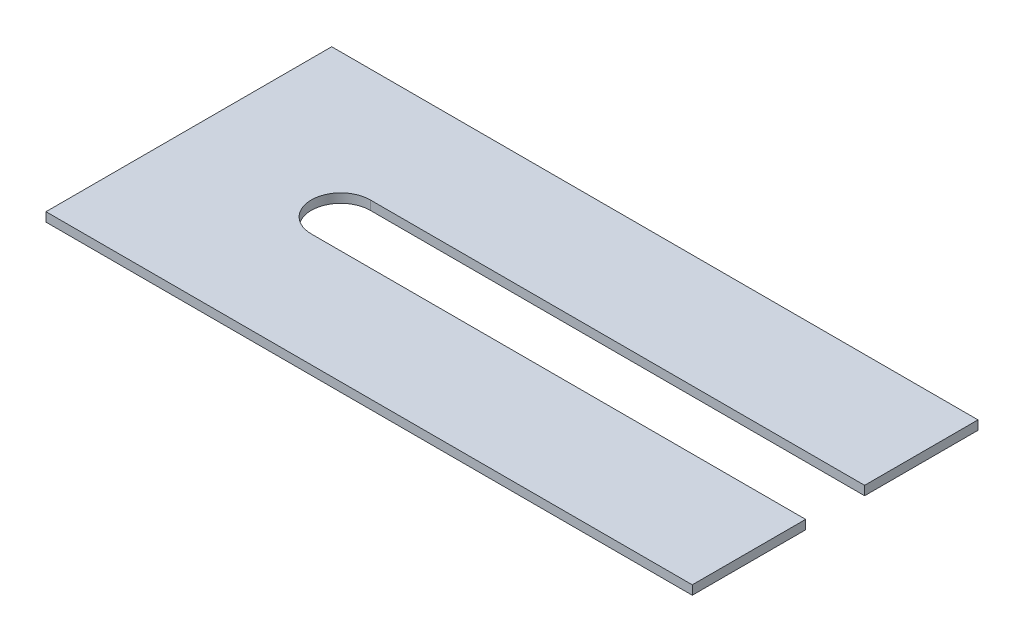
ISO-10303-21;
HEADER;
FILE_DESCRIPTION(('STEP AP214'),'2;1');
FILE_NAME('part.step','',(''),(''),'','','');
FILE_SCHEMA(('AUTOMOTIVE_DESIGN { 1 0 10303 214 1 1 1 1 }'));
ENDSEC;
DATA;
#1=APPLICATION_CONTEXT('core data for automotive mechanical design processes');
#2=APPLICATION_PROTOCOL_DEFINITION('international standard','automotive_design',2000,#1);
#3=PRODUCT_CONTEXT('',#1,'mechanical');
#4=PRODUCT('Part','Part','',(#3));
#5=PRODUCT_RELATED_PRODUCT_CATEGORY('part','',(#4));
#6=PRODUCT_DEFINITION_FORMATION('','',#4);
#7=PRODUCT_DEFINITION_CONTEXT('part definition',#1,'design');
#8=PRODUCT_DEFINITION('design','',#6,#7);
#9=PRODUCT_DEFINITION_SHAPE('','',#8);
#10=(LENGTH_UNIT() NAMED_UNIT(*) SI_UNIT(.MILLI.,.METRE.));
#11=(NAMED_UNIT(*) PLANE_ANGLE_UNIT() SI_UNIT($,.RADIAN.));
#12=(NAMED_UNIT(*) SI_UNIT($,.STERADIAN.) SOLID_ANGLE_UNIT());
#13=UNCERTAINTY_MEASURE_WITH_UNIT(LENGTH_MEASURE(1.E-05),#10,'distance_accuracy_value','');
#14=(GEOMETRIC_REPRESENTATION_CONTEXT(3) GLOBAL_UNCERTAINTY_ASSIGNED_CONTEXT((#13)) GLOBAL_UNIT_ASSIGNED_CONTEXT((#10,
#11,#12)) REPRESENTATION_CONTEXT('',''));
#15=CARTESIAN_POINT('',(0.,0.,0.));
#16=DIRECTION('',(0.,0.,1.));
#17=DIRECTION('',(1.,0.,0.));
#18=AXIS2_PLACEMENT_3D('',#15,#16,#17);
#19=CARTESIAN_POINT('',(16.75,1.,-15.75));
#20=DIRECTION('',(0.,-1.,0.));
#21=DIRECTION('',(0.,0.,-1.));
#22=AXIS2_PLACEMENT_3D('',#19,#20,#21);
#23=CYLINDRICAL_SURFACE('',#22,3.25);
#24=CARTESIAN_POINT('',(16.75,0.,-15.75));
#25=DIRECTION('',(0.,1.,0.));
#26=DIRECTION('',(0.,0.,1.));
#27=AXIS2_PLACEMENT_3D('',#24,#25,#26);
#28=CIRCLE('',#27,3.25);
#29=CARTESIAN_POINT('',(16.75,0.,-19.));
#30=VERTEX_POINT('',#29);
#31=CARTESIAN_POINT('',(16.75,0.,-12.5));
#32=VERTEX_POINT('',#31);
#33=EDGE_CURVE('E191',#30,#32,#28,.T.);
#34=ORIENTED_EDGE('',*,*,#33,.F.);
#35=DIRECTION('',(0.,-1.,0.));
#36=VECTOR('',#35,1.);
#37=CARTESIAN_POINT('',(16.75,1.,-19.));
#38=LINE('',#37,#36);
#39=CARTESIAN_POINT('',(16.75,1.,-19.));
#40=VERTEX_POINT('',#39);
#41=EDGE_CURVE('E11',#40,#30,#38,.T.);
#42=ORIENTED_EDGE('',*,*,#41,.F.);
#43=CARTESIAN_POINT('',(16.75,1.,-15.75));
#44=DIRECTION('',(0.,1.,0.));
#45=DIRECTION('',(0.,0.,1.));
#46=AXIS2_PLACEMENT_3D('',#43,#44,#45);
#47=CIRCLE('',#46,3.25);
#48=CARTESIAN_POINT('',(16.75,1.,-12.5));
#49=VERTEX_POINT('',#48);
#50=EDGE_CURVE('E147',#40,#49,#47,.T.);
#51=ORIENTED_EDGE('',*,*,#50,.T.);
#52=DIRECTION('',(0.,-1.,0.));
#53=VECTOR('',#52,1.);
#54=CARTESIAN_POINT('',(16.75,1.,-12.5));
#55=LINE('',#54,#53);
#56=EDGE_CURVE('E91',#49,#32,#55,.T.);
#57=ORIENTED_EDGE('',*,*,#56,.T.);
#58=EDGE_LOOP('',(#34,#42,#51,#57));
#59=FACE_BOUND('',#58,.T.);
#60=ADVANCED_FACE('F39',(#59),#23,.F.);
#61=CARTESIAN_POINT('',(0.,1.,-19.));
#62=DIRECTION('',(0.,0.,1.));
#63=DIRECTION('',(1.,0.,0.));
#64=AXIS2_PLACEMENT_3D('',#61,#62,#63);
#65=PLANE('',#64);
#66=DIRECTION('',(-1.,0.,0.));
#67=VECTOR('',#66,1.);
#68=CARTESIAN_POINT('',(0.,0.,-19.));
#69=LINE('',#68,#67);
#70=CARTESIAN_POINT('',(71.25,0.,-19.));
#71=VERTEX_POINT('',#70);
#72=EDGE_CURVE('E184',#71,#30,#69,.T.);
#73=ORIENTED_EDGE('',*,*,#72,.F.);
#74=DIRECTION('',(0.,-1.,0.));
#75=VECTOR('',#74,1.);
#76=CARTESIAN_POINT('',(71.25,1.,-19.));
#77=LINE('',#76,#75);
#78=CARTESIAN_POINT('',(71.25,1.,-19.));
#79=VERTEX_POINT('',#78);
#80=EDGE_CURVE('E48',#79,#71,#77,.T.);
#81=ORIENTED_EDGE('',*,*,#80,.F.);
#82=DIRECTION('',(-1.,0.,0.));
#83=VECTOR('',#82,1.);
#84=CARTESIAN_POINT('',(0.,1.,-19.));
#85=LINE('',#84,#83);
#86=EDGE_CURVE('E139',#79,#40,#85,.T.);
#87=ORIENTED_EDGE('',*,*,#86,.T.);
#88=ORIENTED_EDGE('',*,*,#41,.T.);
#89=EDGE_LOOP('',(#73,#81,#87,#88));
#90=FACE_BOUND('',#89,.T.);
#91=ADVANCED_FACE('F189',(#90),#65,.T.);
#92=CARTESIAN_POINT('',(71.25,1.,0.));
#93=DIRECTION('',(-1.,0.,0.));
#94=DIRECTION('',(0.,0.,1.));
#95=AXIS2_PLACEMENT_3D('',#92,#93,#94);
#96=PLANE('',#95);
#97=DIRECTION('',(0.,0.,-1.));
#98=VECTOR('',#97,1.);
#99=CARTESIAN_POINT('',(71.25,0.,0.));
#100=LINE('',#99,#98);
#101=CARTESIAN_POINT('',(71.25,0.,-31.5));
#102=VERTEX_POINT('',#101);
#103=EDGE_CURVE('E159',#71,#102,#100,.T.);
#104=ORIENTED_EDGE('',*,*,#103,.T.);
#105=DIRECTION('',(0.,-1.,0.));
#106=VECTOR('',#105,1.);
#107=CARTESIAN_POINT('',(71.25,1.,-31.5));
#108=LINE('',#107,#106);
#109=CARTESIAN_POINT('',(71.25,1.,-31.5));
#110=VERTEX_POINT('',#109);
#111=EDGE_CURVE('E172',#110,#102,#108,.T.);
#112=ORIENTED_EDGE('',*,*,#111,.F.);
#113=DIRECTION('',(0.,0.,-1.));
#114=VECTOR('',#113,1.);
#115=CARTESIAN_POINT('',(71.25,1.,0.));
#116=LINE('',#115,#114);
#117=EDGE_CURVE('E132',#79,#110,#116,.T.);
#118=ORIENTED_EDGE('',*,*,#117,.F.);
#119=ORIENTED_EDGE('',*,*,#80,.T.);
#120=EDGE_LOOP('',(#104,#112,#118,#119));
#121=FACE_BOUND('',#120,.T.);
#122=ADVANCED_FACE('F178',(#121),#96,.F.);
#123=CARTESIAN_POINT('',(0.,1.,-31.5));
#124=DIRECTION('',(0.,0.,-1.));
#125=DIRECTION('',(-1.,0.,0.));
#126=AXIS2_PLACEMENT_3D('',#123,#124,#125);
#127=PLANE('',#126);
#128=DIRECTION('',(1.,0.,0.));
#129=VECTOR('',#128,1.);
#130=CARTESIAN_POINT('',(0.,0.,-31.5));
#131=LINE('',#130,#129);
#132=CARTESIAN_POINT('',(0.,0.,-31.5));
#133=VERTEX_POINT('',#132);
#134=EDGE_CURVE('E187',#133,#102,#131,.T.);
#135=ORIENTED_EDGE('',*,*,#134,.F.);
#136=DIRECTION('',(0.,-1.,0.));
#137=VECTOR('',#136,1.);
#138=CARTESIAN_POINT('',(0.,1.,-31.5));
#139=LINE('',#138,#137);
#140=CARTESIAN_POINT('',(0.,1.,-31.5));
#141=VERTEX_POINT('',#140);
#142=EDGE_CURVE('E169',#141,#133,#139,.T.);
#143=ORIENTED_EDGE('',*,*,#142,.F.);
#144=DIRECTION('',(1.,0.,0.));
#145=VECTOR('',#144,1.);
#146=CARTESIAN_POINT('',(0.,1.,-31.5));
#147=LINE('',#146,#145);
#148=EDGE_CURVE('E138',#141,#110,#147,.T.);
#149=ORIENTED_EDGE('',*,*,#148,.T.);
#150=ORIENTED_EDGE('',*,*,#111,.T.);
#151=EDGE_LOOP('',(#135,#143,#149,#150));
#152=FACE_BOUND('',#151,.T.);
#153=ADVANCED_FACE('F204',(#152),#127,.T.);
#154=CARTESIAN_POINT('',(0.,1.,0.));
#155=DIRECTION('',(-1.,0.,0.));
#156=DIRECTION('',(0.,0.,1.));
#157=AXIS2_PLACEMENT_3D('',#154,#155,#156);
#158=PLANE('',#157);
#159=DIRECTION('',(0.,0.,-1.));
#160=VECTOR('',#159,1.);
#161=CARTESIAN_POINT('',(0.,0.,0.));
#162=LINE('',#161,#160);
#163=CARTESIAN_POINT('',(0.,0.,0.));
#164=VERTEX_POINT('',#163);
#165=EDGE_CURVE('E197',#164,#133,#162,.T.);
#166=ORIENTED_EDGE('',*,*,#165,.F.);
#167=DIRECTION('',(0.,-1.,0.));
#168=VECTOR('',#167,1.);
#169=CARTESIAN_POINT('',(0.,1.,0.));
#170=LINE('',#169,#168);
#171=CARTESIAN_POINT('',(0.,1.,0.));
#172=VERTEX_POINT('',#171);
#173=EDGE_CURVE('E126',#172,#164,#170,.T.);
#174=ORIENTED_EDGE('',*,*,#173,.F.);
#175=DIRECTION('',(0.,0.,-1.));
#176=VECTOR('',#175,1.);
#177=CARTESIAN_POINT('',(0.,1.,0.));
#178=LINE('',#177,#176);
#179=EDGE_CURVE('E117',#172,#141,#178,.T.);
#180=ORIENTED_EDGE('',*,*,#179,.T.);
#181=ORIENTED_EDGE('',*,*,#142,.T.);
#182=EDGE_LOOP('',(#166,#174,#180,#181));
#183=FACE_BOUND('',#182,.T.);
#184=ADVANCED_FACE('F202',(#183),#158,.T.);
#185=CARTESIAN_POINT('',(0.,1.,0.));
#186=DIRECTION('',(0.,0.,-1.));
#187=DIRECTION('',(-1.,0.,0.));
#188=AXIS2_PLACEMENT_3D('',#185,#186,#187);
#189=PLANE('',#188);
#190=DIRECTION('',(1.,0.,0.));
#191=VECTOR('',#190,1.);
#192=CARTESIAN_POINT('',(0.,0.,0.));
#193=LINE('',#192,#191);
#194=CARTESIAN_POINT('',(71.25,0.,0.));
#195=VERTEX_POINT('',#194);
#196=EDGE_CURVE('E124',#164,#195,#193,.T.);
#197=ORIENTED_EDGE('',*,*,#196,.T.);
#198=DIRECTION('',(0.,-1.,0.));
#199=VECTOR('',#198,1.);
#200=CARTESIAN_POINT('',(71.25,1.,0.));
#201=LINE('',#200,#199);
#202=CARTESIAN_POINT('',(71.25,1.,0.));
#203=VERTEX_POINT('',#202);
#204=EDGE_CURVE('E121',#203,#195,#201,.T.);
#205=ORIENTED_EDGE('',*,*,#204,.F.);
#206=DIRECTION('',(1.,0.,0.));
#207=VECTOR('',#206,1.);
#208=CARTESIAN_POINT('',(0.,1.,0.));
#209=LINE('',#208,#207);
#210=EDGE_CURVE('E110',#172,#203,#209,.T.);
#211=ORIENTED_EDGE('',*,*,#210,.F.);
#212=ORIENTED_EDGE('',*,*,#173,.T.);
#213=EDGE_LOOP('',(#197,#205,#211,#212));
#214=FACE_BOUND('',#213,.T.);
#215=ADVANCED_FACE('F122',(#214),#189,.F.);
#216=CARTESIAN_POINT('',(71.25,0.,-12.5));
#217=VERTEX_POINT('',#216);
#218=EDGE_CURVE('E84',#195,#217,#100,.T.);
#219=ORIENTED_EDGE('',*,*,#218,.T.);
#220=DIRECTION('',(0.,-1.,0.));
#221=VECTOR('',#220,1.);
#222=CARTESIAN_POINT('',(71.25,1.,-12.5));
#223=LINE('',#222,#221);
#224=CARTESIAN_POINT('',(71.25,1.,-12.5));
#225=VERTEX_POINT('',#224);
#226=EDGE_CURVE('E127',#225,#217,#223,.T.);
#227=ORIENTED_EDGE('',*,*,#226,.F.);
#228=EDGE_CURVE('E114',#203,#225,#116,.T.);
#229=ORIENTED_EDGE('',*,*,#228,.F.);
#230=ORIENTED_EDGE('',*,*,#204,.T.);
#231=EDGE_LOOP('',(#219,#227,#229,#230));
#232=FACE_BOUND('',#231,.T.);
#233=ADVANCED_FACE('F129',(#232),#96,.F.);
#234=CARTESIAN_POINT('',(0.,1.,-12.5));
#235=DIRECTION('',(0.,0.,1.));
#236=DIRECTION('',(1.,0.,0.));
#237=AXIS2_PLACEMENT_3D('',#234,#235,#236);
#238=PLANE('',#237);
#239=DIRECTION('',(-1.,0.,0.));
#240=VECTOR('',#239,1.);
#241=CARTESIAN_POINT('',(0.,0.,-12.5));
#242=LINE('',#241,#240);
#243=EDGE_CURVE('E150',#217,#32,#242,.T.);
#244=ORIENTED_EDGE('',*,*,#243,.T.);
#245=ORIENTED_EDGE('',*,*,#56,.F.);
#246=DIRECTION('',(-1.,0.,0.));
#247=VECTOR('',#246,1.);
#248=CARTESIAN_POINT('',(0.,1.,-12.5));
#249=LINE('',#248,#247);
#250=EDGE_CURVE('E56',#225,#49,#249,.T.);
#251=ORIENTED_EDGE('',*,*,#250,.F.);
#252=ORIENTED_EDGE('',*,*,#226,.T.);
#253=EDGE_LOOP('',(#244,#245,#251,#252));
#254=FACE_BOUND('',#253,.T.);
#255=ADVANCED_FACE('F250',(#254),#238,.F.);
#256=CARTESIAN_POINT('',(0.,1.,0.));
#257=DIRECTION('',(0.,1.,0.));
#258=DIRECTION('',(0.,0.,1.));
#259=AXIS2_PLACEMENT_3D('',#256,#257,#258);
#260=PLANE('',#259);
#261=ORIENTED_EDGE('',*,*,#50,.F.);
#262=ORIENTED_EDGE('',*,*,#86,.F.);
#263=ORIENTED_EDGE('',*,*,#117,.T.);
#264=ORIENTED_EDGE('',*,*,#148,.F.);
#265=ORIENTED_EDGE('',*,*,#179,.F.);
#266=ORIENTED_EDGE('',*,*,#210,.T.);
#267=ORIENTED_EDGE('',*,*,#228,.T.);
#268=ORIENTED_EDGE('',*,*,#250,.T.);
#269=EDGE_LOOP('',(#261,#262,#263,#264,#265,#266,#267,#268));
#270=FACE_BOUND('',#269,.T.);
#271=ADVANCED_FACE('F112',(#270),#260,.T.);
#272=CARTESIAN_POINT('',(0.,0.,0.));
#273=DIRECTION('',(0.,1.,0.));
#274=DIRECTION('',(0.,0.,1.));
#275=AXIS2_PLACEMENT_3D('',#272,#273,#274);
#276=PLANE('',#275);
#277=ORIENTED_EDGE('',*,*,#33,.T.);
#278=ORIENTED_EDGE('',*,*,#243,.F.);
#279=ORIENTED_EDGE('',*,*,#218,.F.);
#280=ORIENTED_EDGE('',*,*,#196,.F.);
#281=ORIENTED_EDGE('',*,*,#165,.T.);
#282=ORIENTED_EDGE('',*,*,#134,.T.);
#283=ORIENTED_EDGE('',*,*,#103,.F.);
#284=ORIENTED_EDGE('',*,*,#72,.T.);
#285=EDGE_LOOP('',(#277,#278,#279,#280,#281,#282,#283,#284));
#286=FACE_BOUND('',#285,.T.);
#287=ADVANCED_FACE('F183',(#286),#276,.F.);
#288=CLOSED_SHELL('',(#60,#91,#122,#153,#184,#215,#233,#255,#271,#287));
#289=MANIFOLD_SOLID_BREP('B2',#288);
#290=ADVANCED_BREP_SHAPE_REPRESENTATION('',(#18,#289),#14);
#291=SHAPE_DEFINITION_REPRESENTATION(#9,#290);
ENDSEC;
END-ISO-10303-21;
